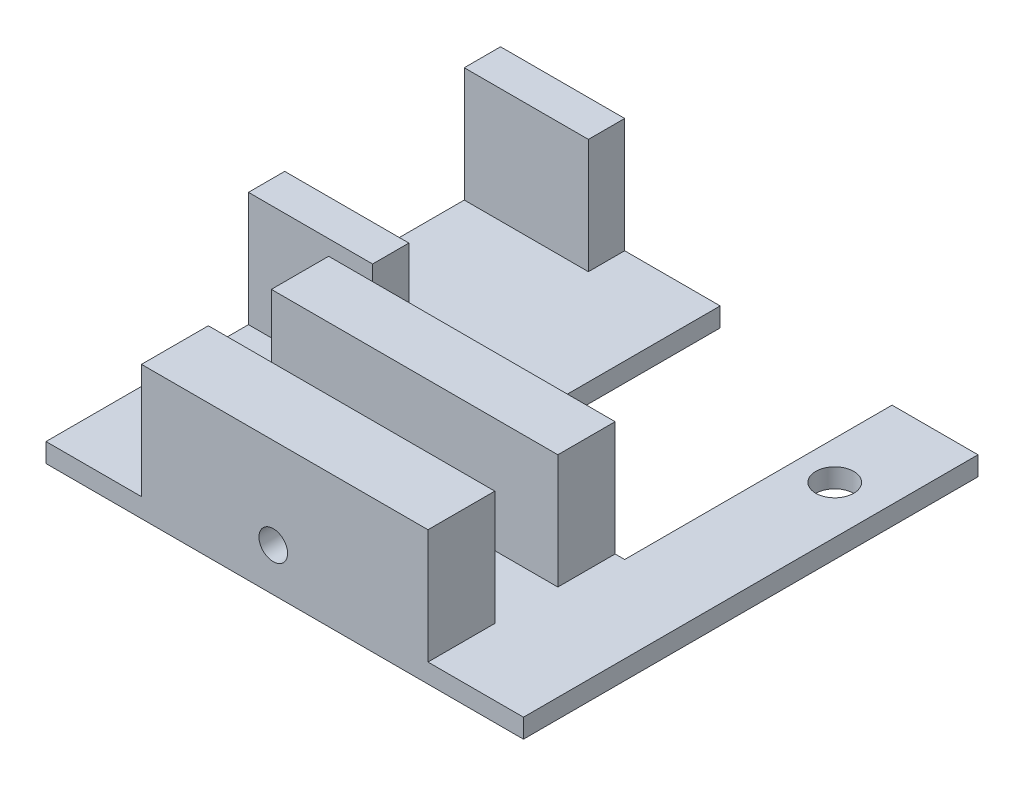
ISO-10303-21;
HEADER;
FILE_DESCRIPTION(('STEP AP214'),'2;1');
FILE_NAME('part.step','',(''),(''),'','','');
FILE_SCHEMA(('AUTOMOTIVE_DESIGN { 1 0 10303 214 1 1 1 1 }'));
ENDSEC;
DATA;
#1=APPLICATION_CONTEXT('core data for automotive mechanical design processes');
#2=APPLICATION_PROTOCOL_DEFINITION('international standard','automotive_design',2000,#1);
#3=PRODUCT_CONTEXT('',#1,'mechanical');
#4=PRODUCT('Part','Part','',(#3));
#5=PRODUCT_RELATED_PRODUCT_CATEGORY('part','',(#4));
#6=PRODUCT_DEFINITION_FORMATION('','',#4);
#7=PRODUCT_DEFINITION_CONTEXT('part definition',#1,'design');
#8=PRODUCT_DEFINITION('design','',#6,#7);
#9=PRODUCT_DEFINITION_SHAPE('','',#8);
#10=(LENGTH_UNIT() NAMED_UNIT(*) SI_UNIT(.MILLI.,.METRE.));
#11=(NAMED_UNIT(*) PLANE_ANGLE_UNIT() SI_UNIT($,.RADIAN.));
#12=(NAMED_UNIT(*) SI_UNIT($,.STERADIAN.) SOLID_ANGLE_UNIT());
#13=UNCERTAINTY_MEASURE_WITH_UNIT(LENGTH_MEASURE(1.E-05),#10,'distance_accuracy_value','');
#14=(GEOMETRIC_REPRESENTATION_CONTEXT(3) GLOBAL_UNCERTAINTY_ASSIGNED_CONTEXT((#13)) GLOBAL_UNIT_ASSIGNED_CONTEXT((#10,
#11,#12)) REPRESENTATION_CONTEXT('',''));
#15=CARTESIAN_POINT('',(0.,0.,0.));
#16=DIRECTION('',(0.,0.,1.));
#17=DIRECTION('',(1.,0.,0.));
#18=AXIS2_PLACEMENT_3D('',#15,#16,#17);
#19=CARTESIAN_POINT('',(0.,1.27,0.));
#20=DIRECTION('',(0.,-1.,0.));
#21=DIRECTION('',(0.,0.,-1.));
#22=AXIS2_PLACEMENT_3D('',#19,#20,#21);
#23=PLANE('',#22);
#24=CARTESIAN_POINT('',(-6.34999999999987,1.27,1.524));
#25=DIRECTION('',(0.,1.,0.));
#26=DIRECTION('',(0.,0.,1.));
#27=AXIS2_PLACEMENT_3D('',#24,#25,#26);
#28=CIRCLE('',#27,2.52729999999999);
#29=CARTESIAN_POINT('',(-6.34999999999987,1.27,4.0513));
#30=VERTEX_POINT('',#29);
#31=EDGE_CURVE('E913',#30,#30,#28,.T.);
#32=ORIENTED_EDGE('',*,*,#31,.F.);
#33=EDGE_LOOP('',(#32));
#34=FACE_BOUND('',#33,.T.);
#35=CARTESIAN_POINT('',(-19.05,1.27,17.399));
#36=DIRECTION('',(0.,1.,0.));
#37=DIRECTION('',(0.,0.,1.));
#38=AXIS2_PLACEMENT_3D('',#35,#36,#37);
#39=CIRCLE('',#38,2.5273);
#40=CARTESIAN_POINT('',(-19.05,1.27,19.9263));
#41=VERTEX_POINT('',#40);
#42=EDGE_CURVE('E905',#41,#41,#39,.T.);
#43=ORIENTED_EDGE('',*,*,#42,.F.);
#44=EDGE_LOOP('',(#43));
#45=FACE_BOUND('',#44,.T.);
#46=CARTESIAN_POINT('',(25.4,1.27,-17.526));
#47=DIRECTION('',(0.,1.,0.));
#48=DIRECTION('',(0.,0.,1.));
#49=AXIS2_PLACEMENT_3D('',#46,#47,#48);
#50=CIRCLE('',#49,2.5273);
#51=CARTESIAN_POINT('',(25.4,1.27,-14.9987));
#52=VERTEX_POINT('',#51);
#53=EDGE_CURVE('E897',#52,#52,#50,.T.);
#54=ORIENTED_EDGE('',*,*,#53,.F.);
#55=EDGE_LOOP('',(#54));
#56=FACE_BOUND('',#55,.T.);
#57=DIRECTION('',(0.,0.,1.));
#58=VECTOR('',#57,1.);
#59=CARTESIAN_POINT('',(-2.53999999999988,1.27,0.));
#60=LINE('',#59,#58);
#61=CARTESIAN_POINT('',(-2.53999999999988,1.27,-30.226));
#62=VERTEX_POINT('',#61);
#63=CARTESIAN_POINT('',(-2.53999999999988,1.27,5.334));
#64=VERTEX_POINT('',#63);
#65=EDGE_CURVE('E338',#62,#64,#60,.T.);
#66=ORIENTED_EDGE('',*,*,#65,.F.);
#67=DIRECTION('',(-1.,0.,0.));
#68=VECTOR('',#67,1.);
#69=CARTESIAN_POINT('',(-31.75,1.27,-30.226));
#70=LINE('',#69,#68);
#71=CARTESIAN_POINT('',(-15.24,1.27,-30.226));
#72=VERTEX_POINT('',#71);
#73=EDGE_CURVE('E224',#62,#72,#70,.T.);
#74=ORIENTED_EDGE('',*,*,#73,.T.);
#75=DIRECTION('',(0.,0.,-1.));
#76=VECTOR('',#75,1.);
#77=CARTESIAN_POINT('',(-15.24,1.27,-30.226));
#78=LINE('',#77,#76);
#79=CARTESIAN_POINT('',(-15.24,1.27,-25.4));
#80=VERTEX_POINT('',#79);
#81=EDGE_CURVE('E289',#80,#72,#78,.T.);
#82=ORIENTED_EDGE('',*,*,#81,.F.);
#83=DIRECTION('',(1.,0.,0.));
#84=VECTOR('',#83,1.);
#85=CARTESIAN_POINT('',(-31.75,1.27,-25.4));
#86=LINE('',#85,#84);
#87=CARTESIAN_POINT('',(-31.75,1.27,-25.4));
#88=VERTEX_POINT('',#87);
#89=EDGE_CURVE('E285',#88,#80,#86,.T.);
#90=ORIENTED_EDGE('',*,*,#89,.F.);
#91=DIRECTION('',(0.,0.,1.));
#92=VECTOR('',#91,1.);
#93=CARTESIAN_POINT('',(-31.75,1.27,30.226));
#94=LINE('',#93,#92);
#95=CARTESIAN_POINT('',(-31.75,1.27,-1.524));
#96=VERTEX_POINT('',#95);
#97=EDGE_CURVE('E308',#88,#96,#94,.T.);
#98=ORIENTED_EDGE('',*,*,#97,.T.);
#99=DIRECTION('',(-1.,0.,0.));
#100=VECTOR('',#99,1.);
#101=CARTESIAN_POINT('',(-31.75,1.27,-1.524));
#102=LINE('',#101,#100);
#103=CARTESIAN_POINT('',(-15.24,1.27,-1.524));
#104=VERTEX_POINT('',#103);
#105=EDGE_CURVE('E455',#104,#96,#102,.T.);
#106=ORIENTED_EDGE('',*,*,#105,.F.);
#107=DIRECTION('',(0.,0.,-1.));
#108=VECTOR('',#107,1.);
#109=CARTESIAN_POINT('',(-15.24,1.27,-1.524));
#110=LINE('',#109,#108);
#111=CARTESIAN_POINT('',(-15.24,1.27,3.302));
#112=VERTEX_POINT('',#111);
#113=EDGE_CURVE('E459',#112,#104,#110,.T.);
#114=ORIENTED_EDGE('',*,*,#113,.F.);
#115=DIRECTION('',(1.,0.,0.));
#116=VECTOR('',#115,1.);
#117=CARTESIAN_POINT('',(-31.75,1.27,3.302));
#118=LINE('',#117,#116);
#119=CARTESIAN_POINT('',(-31.75,1.27,3.302));
#120=VERTEX_POINT('',#119);
#121=EDGE_CURVE('E290',#120,#112,#118,.T.);
#122=ORIENTED_EDGE('',*,*,#121,.F.);
#123=CARTESIAN_POINT('',(-31.75,1.27,30.226));
#124=VERTEX_POINT('',#123);
#125=EDGE_CURVE('E307',#120,#124,#94,.T.);
#126=ORIENTED_EDGE('',*,*,#125,.T.);
#127=DIRECTION('',(1.,0.,0.));
#128=VECTOR('',#127,1.);
#129=CARTESIAN_POINT('',(-31.75,1.27,30.226));
#130=LINE('',#129,#128);
#131=CARTESIAN_POINT('',(-19.05,1.27,30.226));
#132=VERTEX_POINT('',#131);
#133=EDGE_CURVE('E255',#124,#132,#130,.T.);
#134=ORIENTED_EDGE('',*,*,#133,.T.);
#135=DIRECTION('',(0.,0.,1.));
#136=VECTOR('',#135,1.);
#137=CARTESIAN_POINT('',(-19.05,1.27,30.226));
#138=LINE('',#137,#136);
#139=CARTESIAN_POINT('',(-19.05,1.27,21.336));
#140=VERTEX_POINT('',#139);
#141=EDGE_CURVE('E423',#140,#132,#138,.T.);
#142=ORIENTED_EDGE('',*,*,#141,.F.);
#143=DIRECTION('',(-1.,0.,0.));
#144=VECTOR('',#143,1.);
#145=CARTESIAN_POINT('',(-19.05,1.27,21.336));
#146=LINE('',#145,#144);
#147=CARTESIAN_POINT('',(19.05,1.27,21.336));
#148=VERTEX_POINT('',#147);
#149=EDGE_CURVE('E416',#148,#140,#146,.T.);
#150=ORIENTED_EDGE('',*,*,#149,.F.);
#151=DIRECTION('',(0.,0.,-1.));
#152=VECTOR('',#151,1.);
#153=CARTESIAN_POINT('',(19.05,1.27,30.226));
#154=LINE('',#153,#152);
#155=CARTESIAN_POINT('',(19.05,1.27,30.226));
#156=VERTEX_POINT('',#155);
#157=EDGE_CURVE('E321',#156,#148,#154,.T.);
#158=ORIENTED_EDGE('',*,*,#157,.F.);
#159=CARTESIAN_POINT('',(31.75,1.27,30.226));
#160=VERTEX_POINT('',#159);
#161=EDGE_CURVE('E310',#156,#160,#130,.T.);
#162=ORIENTED_EDGE('',*,*,#161,.T.);
#163=DIRECTION('',(0.,0.,-1.));
#164=VECTOR('',#163,1.);
#165=CARTESIAN_POINT('',(31.75,1.27,30.226));
#166=LINE('',#165,#164);
#167=CARTESIAN_POINT('',(31.75,1.27,-30.226));
#168=VERTEX_POINT('',#167);
#169=EDGE_CURVE('E249',#160,#168,#166,.T.);
#170=ORIENTED_EDGE('',*,*,#169,.T.);
#171=CARTESIAN_POINT('',(20.32,1.27,-30.226));
#172=VERTEX_POINT('',#171);
#173=EDGE_CURVE('E303',#168,#172,#70,.T.);
#174=ORIENTED_EDGE('',*,*,#173,.T.);
#175=DIRECTION('',(0.,0.,1.));
#176=VECTOR('',#175,1.);
#177=CARTESIAN_POINT('',(20.3200000000001,1.27,0.));
#178=LINE('',#177,#176);
#179=CARTESIAN_POINT('',(20.32,1.27,5.334));
#180=VERTEX_POINT('',#179);
#181=EDGE_CURVE('E331',#172,#180,#178,.T.);
#182=ORIENTED_EDGE('',*,*,#181,.T.);
#183=DIRECTION('',(-1.,0.,0.));
#184=VECTOR('',#183,1.);
#185=CARTESIAN_POINT('',(0.,1.27,5.334));
#186=LINE('',#185,#184);
#187=CARTESIAN_POINT('',(19.05,1.27,5.334));
#188=VERTEX_POINT('',#187);
#189=EDGE_CURVE('E333',#180,#188,#186,.T.);
#190=ORIENTED_EDGE('',*,*,#189,.T.);
#191=DIRECTION('',(0.,0.,-1.));
#192=VECTOR('',#191,1.);
#193=CARTESIAN_POINT('',(19.05,1.27,12.954));
#194=LINE('',#193,#192);
#195=CARTESIAN_POINT('',(19.05,1.27,12.954));
#196=VERTEX_POINT('',#195);
#197=EDGE_CURVE('E377',#196,#188,#194,.T.);
#198=ORIENTED_EDGE('',*,*,#197,.F.);
#199=DIRECTION('',(1.,0.,0.));
#200=VECTOR('',#199,1.);
#201=CARTESIAN_POINT('',(-19.05,1.27,12.954));
#202=LINE('',#201,#200);
#203=CARTESIAN_POINT('',(-1.52400000000001,1.27,12.954));
#204=VERTEX_POINT('',#203);
#205=EDGE_CURVE('E381',#204,#196,#202,.T.);
#206=ORIENTED_EDGE('',*,*,#205,.F.);
#207=CARTESIAN_POINT('',(-19.05,1.27,12.954));
#208=VERTEX_POINT('',#207);
#209=EDGE_CURVE('E382',#208,#204,#202,.T.);
#210=ORIENTED_EDGE('',*,*,#209,.F.);
#211=DIRECTION('',(0.,0.,1.));
#212=VECTOR('',#211,1.);
#213=CARTESIAN_POINT('',(-19.05,1.27,12.954));
#214=LINE('',#213,#212);
#215=CARTESIAN_POINT('',(-19.05,1.27,5.334));
#216=VERTEX_POINT('',#215);
#217=EDGE_CURVE('E386',#216,#208,#214,.T.);
#218=ORIENTED_EDGE('',*,*,#217,.F.);
#219=DIRECTION('',(-1.,0.,0.));
#220=VECTOR('',#219,1.);
#221=CARTESIAN_POINT('',(-19.05,1.27,5.334));
#222=LINE('',#221,#220);
#223=EDGE_CURVE('E374',#64,#216,#222,.T.);
#224=ORIENTED_EDGE('',*,*,#223,.F.);
#225=EDGE_LOOP('',(#66,#74,#82,#90,#98,#106,#114,#122,#126,#134,#142,#150,#158,#162,#170,#174,
#182,#190,#198,#206,#210,#218,#224));
#226=FACE_BOUND('',#225,.T.);
#227=ADVANCED_FACE('F45',(#34,#45,#56,#226),#23,.F.);
#228=CARTESIAN_POINT('',(-31.75,1.27,-30.226));
#229=DIRECTION('',(0.,0.,1.));
#230=DIRECTION('',(1.,0.,0.));
#231=AXIS2_PLACEMENT_3D('',#228,#229,#230);
#232=PLANE('',#231);
#233=DIRECTION('',(0.,-1.,0.));
#234=VECTOR('',#233,1.);
#235=CARTESIAN_POINT('',(-2.53999999999988,16.51,-30.226));
#236=LINE('',#235,#234);
#237=CARTESIAN_POINT('',(-2.53999999999988,-1.27,-30.226));
#238=VERTEX_POINT('',#237);
#239=EDGE_CURVE('E206',#62,#238,#236,.T.);
#240=ORIENTED_EDGE('',*,*,#239,.T.);
#241=DIRECTION('',(-1.,0.,0.));
#242=VECTOR('',#241,1.);
#243=CARTESIAN_POINT('',(-31.75,-1.27,-30.226));
#244=LINE('',#243,#242);
#245=CARTESIAN_POINT('',(-31.75,-1.27,-30.226));
#246=VERTEX_POINT('',#245);
#247=EDGE_CURVE('E221',#238,#246,#244,.T.);
#248=ORIENTED_EDGE('',*,*,#247,.T.);
#249=DIRECTION('',(0.,-1.,0.));
#250=VECTOR('',#249,1.);
#251=CARTESIAN_POINT('',(-31.75,1.27,-30.226));
#252=LINE('',#251,#250);
#253=CARTESIAN_POINT('',(-31.75,16.51,-30.226));
#254=VERTEX_POINT('',#253);
#255=EDGE_CURVE('E54',#254,#246,#252,.T.);
#256=ORIENTED_EDGE('',*,*,#255,.F.);
#257=DIRECTION('',(-1.,0.,0.));
#258=VECTOR('',#257,1.);
#259=CARTESIAN_POINT('',(-31.75,16.51,-30.226));
#260=LINE('',#259,#258);
#261=CARTESIAN_POINT('',(-15.24,16.51,-30.226));
#262=VERTEX_POINT('',#261);
#263=EDGE_CURVE('E268',#262,#254,#260,.T.);
#264=ORIENTED_EDGE('',*,*,#263,.F.);
#265=DIRECTION('',(0.,-1.,0.));
#266=VECTOR('',#265,1.);
#267=CARTESIAN_POINT('',(-15.24,16.51,-30.226));
#268=LINE('',#267,#266);
#269=EDGE_CURVE('E275',#262,#72,#268,.T.);
#270=ORIENTED_EDGE('',*,*,#269,.T.);
#271=ORIENTED_EDGE('',*,*,#73,.F.);
#272=EDGE_LOOP('',(#240,#248,#256,#264,#270,#271));
#273=FACE_BOUND('',#272,.T.);
#274=ADVANCED_FACE('F220',(#273),#232,.F.);
#275=CARTESIAN_POINT('',(0.,-1.27,0.));
#276=DIRECTION('',(0.,-1.,0.));
#277=DIRECTION('',(0.,0.,-1.));
#278=AXIS2_PLACEMENT_3D('',#275,#276,#277);
#279=PLANE('',#278);
#280=CARTESIAN_POINT('',(-6.34999999999987,-1.27,1.524));
#281=DIRECTION('',(0.,1.,0.));
#282=DIRECTION('',(0.,0.,1.));
#283=AXIS2_PLACEMENT_3D('',#280,#281,#282);
#284=CIRCLE('',#283,2.5273);
#285=CARTESIAN_POINT('',(-6.34999999999987,-1.27,4.0513));
#286=VERTEX_POINT('',#285);
#287=EDGE_CURVE('E909',#286,#286,#284,.T.);
#288=ORIENTED_EDGE('',*,*,#287,.T.);
#289=EDGE_LOOP('',(#288));
#290=FACE_BOUND('',#289,.T.);
#291=CARTESIAN_POINT('',(-19.05,-1.27,17.399));
#292=DIRECTION('',(0.,1.,0.));
#293=DIRECTION('',(0.,0.,1.));
#294=AXIS2_PLACEMENT_3D('',#291,#292,#293);
#295=CIRCLE('',#294,2.5273);
#296=CARTESIAN_POINT('',(-19.05,-1.27,19.9263));
#297=VERTEX_POINT('',#296);
#298=EDGE_CURVE('E901',#297,#297,#295,.T.);
#299=ORIENTED_EDGE('',*,*,#298,.T.);
#300=EDGE_LOOP('',(#299));
#301=FACE_BOUND('',#300,.T.);
#302=CARTESIAN_POINT('',(25.4,-1.27,-17.526));
#303=DIRECTION('',(0.,1.,0.));
#304=DIRECTION('',(0.,0.,1.));
#305=AXIS2_PLACEMENT_3D('',#302,#303,#304);
#306=CIRCLE('',#305,2.5273);
#307=CARTESIAN_POINT('',(25.4,-1.27,-14.9987));
#308=VERTEX_POINT('',#307);
#309=EDGE_CURVE('E216',#308,#308,#306,.T.);
#310=ORIENTED_EDGE('',*,*,#309,.T.);
#311=EDGE_LOOP('',(#310));
#312=FACE_BOUND('',#311,.T.);
#313=ORIENTED_EDGE('',*,*,#247,.F.);
#314=DIRECTION('',(0.,0.,1.));
#315=VECTOR('',#314,1.);
#316=CARTESIAN_POINT('',(-2.53999999999988,-1.27,0.));
#317=LINE('',#316,#315);
#318=CARTESIAN_POINT('',(-2.53999999999988,-1.27,5.334));
#319=VERTEX_POINT('',#318);
#320=EDGE_CURVE('E203',#238,#319,#317,.T.);
#321=ORIENTED_EDGE('',*,*,#320,.T.);
#322=DIRECTION('',(-1.,0.,0.));
#323=VECTOR('',#322,1.);
#324=CARTESIAN_POINT('',(0.,-1.27,5.334));
#325=LINE('',#324,#323);
#326=CARTESIAN_POINT('',(20.32,-1.27,5.334));
#327=VERTEX_POINT('',#326);
#328=EDGE_CURVE('E226',#327,#319,#325,.T.);
#329=ORIENTED_EDGE('',*,*,#328,.F.);
#330=DIRECTION('',(0.,0.,1.));
#331=VECTOR('',#330,1.);
#332=CARTESIAN_POINT('',(20.3200000000001,-1.27,0.));
#333=LINE('',#332,#331);
#334=CARTESIAN_POINT('',(20.32,-1.27,-30.226));
#335=VERTEX_POINT('',#334);
#336=EDGE_CURVE('E215',#335,#327,#333,.T.);
#337=ORIENTED_EDGE('',*,*,#336,.F.);
#338=CARTESIAN_POINT('',(31.75,-1.27,-30.226));
#339=VERTEX_POINT('',#338);
#340=EDGE_CURVE('E233',#339,#335,#244,.T.);
#341=ORIENTED_EDGE('',*,*,#340,.F.);
#342=DIRECTION('',(0.,0.,-1.));
#343=VECTOR('',#342,1.);
#344=CARTESIAN_POINT('',(31.75,-1.27,30.226));
#345=LINE('',#344,#343);
#346=CARTESIAN_POINT('',(31.75,-1.27,30.226));
#347=VERTEX_POINT('',#346);
#348=EDGE_CURVE('E234',#347,#339,#345,.T.);
#349=ORIENTED_EDGE('',*,*,#348,.F.);
#350=DIRECTION('',(1.,0.,0.));
#351=VECTOR('',#350,1.);
#352=CARTESIAN_POINT('',(-31.75,-1.27,30.226));
#353=LINE('',#352,#351);
#354=CARTESIAN_POINT('',(-31.75,-1.27,30.226));
#355=VERTEX_POINT('',#354);
#356=EDGE_CURVE('E246',#355,#347,#353,.T.);
#357=ORIENTED_EDGE('',*,*,#356,.F.);
#358=DIRECTION('',(0.,0.,1.));
#359=VECTOR('',#358,1.);
#360=CARTESIAN_POINT('',(-31.75,-1.27,30.226));
#361=LINE('',#360,#359);
#362=EDGE_CURVE('E231',#246,#355,#361,.T.);
#363=ORIENTED_EDGE('',*,*,#362,.F.);
#364=EDGE_LOOP('',(#313,#321,#329,#337,#341,#349,#357,#363));
#365=FACE_BOUND('',#364,.T.);
#366=ADVANCED_FACE('F229',(#290,#301,#312,#365),#279,.T.);
#367=CARTESIAN_POINT('',(31.75,1.27,30.226));
#368=DIRECTION('',(-1.,0.,0.));
#369=DIRECTION('',(0.,0.,1.));
#370=AXIS2_PLACEMENT_3D('',#367,#368,#369);
#371=PLANE('',#370);
#372=ORIENTED_EDGE('',*,*,#348,.T.);
#373=DIRECTION('',(0.,-1.,0.));
#374=VECTOR('',#373,1.);
#375=CARTESIAN_POINT('',(31.75,1.27,-30.226));
#376=LINE('',#375,#374);
#377=EDGE_CURVE('E12',#168,#339,#376,.T.);
#378=ORIENTED_EDGE('',*,*,#377,.F.);
#379=ORIENTED_EDGE('',*,*,#169,.F.);
#380=DIRECTION('',(0.,-1.,0.));
#381=VECTOR('',#380,1.);
#382=CARTESIAN_POINT('',(31.75,1.27,30.226));
#383=LINE('',#382,#381);
#384=EDGE_CURVE('E250',#160,#347,#383,.T.);
#385=ORIENTED_EDGE('',*,*,#384,.T.);
#386=EDGE_LOOP('',(#372,#378,#379,#385));
#387=FACE_BOUND('',#386,.T.);
#388=ADVANCED_FACE('F47',(#387),#371,.F.);
#389=ORIENTED_EDGE('',*,*,#340,.T.);
#390=DIRECTION('',(0.,-1.,0.));
#391=VECTOR('',#390,1.);
#392=CARTESIAN_POINT('',(20.32,16.51,-30.226));
#393=LINE('',#392,#391);
#394=EDGE_CURVE('E61',#172,#335,#393,.T.);
#395=ORIENTED_EDGE('',*,*,#394,.F.);
#396=ORIENTED_EDGE('',*,*,#173,.F.);
#397=ORIENTED_EDGE('',*,*,#377,.T.);
#398=EDGE_LOOP('',(#389,#395,#396,#397));
#399=FACE_BOUND('',#398,.T.);
#400=ADVANCED_FACE('F329',(#399),#232,.F.);
#401=CARTESIAN_POINT('',(-31.75,1.27,30.226));
#402=DIRECTION('',(1.,0.,0.));
#403=DIRECTION('',(0.,0.,-1.));
#404=AXIS2_PLACEMENT_3D('',#401,#402,#403);
#405=PLANE('',#404);
#406=ORIENTED_EDGE('',*,*,#362,.T.);
#407=DIRECTION('',(0.,-1.,0.));
#408=VECTOR('',#407,1.);
#409=CARTESIAN_POINT('',(-31.75,1.27,30.226));
#410=LINE('',#409,#408);
#411=EDGE_CURVE('E254',#124,#355,#410,.T.);
#412=ORIENTED_EDGE('',*,*,#411,.F.);
#413=ORIENTED_EDGE('',*,*,#125,.F.);
#414=DIRECTION('',(0.,-1.,0.));
#415=VECTOR('',#414,1.);
#416=CARTESIAN_POINT('',(-31.75,16.51,3.302));
#417=LINE('',#416,#415);
#418=CARTESIAN_POINT('',(-31.75,16.51,3.302));
#419=VERTEX_POINT('',#418);
#420=EDGE_CURVE('E427',#419,#120,#417,.T.);
#421=ORIENTED_EDGE('',*,*,#420,.F.);
#422=DIRECTION('',(0.,0.,1.));
#423=VECTOR('',#422,1.);
#424=CARTESIAN_POINT('',(-31.75,16.51,-1.524));
#425=LINE('',#424,#423);
#426=CARTESIAN_POINT('',(-31.75,16.51,-1.524));
#427=VERTEX_POINT('',#426);
#428=EDGE_CURVE('E460',#427,#419,#425,.T.);
#429=ORIENTED_EDGE('',*,*,#428,.F.);
#430=DIRECTION('',(0.,-1.,0.));
#431=VECTOR('',#430,1.);
#432=CARTESIAN_POINT('',(-31.75,16.51,-1.524));
#433=LINE('',#432,#431);
#434=EDGE_CURVE('E450',#427,#96,#433,.T.);
#435=ORIENTED_EDGE('',*,*,#434,.T.);
#436=ORIENTED_EDGE('',*,*,#97,.F.);
#437=DIRECTION('',(0.,-1.,0.));
#438=VECTOR('',#437,1.);
#439=CARTESIAN_POINT('',(-31.75,16.51,-25.4));
#440=LINE('',#439,#438);
#441=CARTESIAN_POINT('',(-31.75,16.51,-25.4));
#442=VERTEX_POINT('',#441);
#443=EDGE_CURVE('E240',#442,#88,#440,.T.);
#444=ORIENTED_EDGE('',*,*,#443,.F.);
#445=DIRECTION('',(0.,0.,1.));
#446=VECTOR('',#445,1.);
#447=CARTESIAN_POINT('',(-31.75,16.51,-30.226));
#448=LINE('',#447,#446);
#449=EDGE_CURVE('E265',#254,#442,#448,.T.);
#450=ORIENTED_EDGE('',*,*,#449,.F.);
#451=ORIENTED_EDGE('',*,*,#255,.T.);
#452=EDGE_LOOP('',(#406,#412,#413,#421,#429,#435,#436,#444,#450,#451));
#453=FACE_BOUND('',#452,.T.);
#454=ADVANCED_FACE('F261',(#453),#405,.F.);
#455=CARTESIAN_POINT('',(-31.75,1.27,30.226));
#456=DIRECTION('',(0.,0.,-1.));
#457=DIRECTION('',(-1.,0.,0.));
#458=AXIS2_PLACEMENT_3D('',#455,#456,#457);
#459=PLANE('',#458);
#460=CARTESIAN_POINT('',(-1.52400000000001,4.445,30.226));
#461=DIRECTION('',(0.,0.,-1.));
#462=DIRECTION('',(-1.,0.,0.));
#463=AXIS2_PLACEMENT_3D('',#460,#461,#462);
#464=CIRCLE('',#463,1.905);
#465=CARTESIAN_POINT('',(-3.42900000000001,4.445,30.226));
#466=VERTEX_POINT('',#465);
#467=EDGE_CURVE('E349',#466,#466,#464,.T.);
#468=ORIENTED_EDGE('',*,*,#467,.T.);
#469=EDGE_LOOP('',(#468));
#470=FACE_BOUND('',#469,.T.);
#471=ORIENTED_EDGE('',*,*,#356,.T.);
#472=ORIENTED_EDGE('',*,*,#384,.F.);
#473=ORIENTED_EDGE('',*,*,#161,.F.);
#474=DIRECTION('',(0.,-1.,0.));
#475=VECTOR('',#474,1.);
#476=CARTESIAN_POINT('',(19.05,16.51,30.226));
#477=LINE('',#476,#475);
#478=CARTESIAN_POINT('',(19.05,16.51,30.226));
#479=VERTEX_POINT('',#478);
#480=EDGE_CURVE('E404',#479,#156,#477,.T.);
#481=ORIENTED_EDGE('',*,*,#480,.F.);
#482=DIRECTION('',(1.,0.,0.));
#483=VECTOR('',#482,1.);
#484=CARTESIAN_POINT('',(-19.05,16.51,30.226));
#485=LINE('',#484,#483);
#486=CARTESIAN_POINT('',(-19.05,16.51,30.226));
#487=VERTEX_POINT('',#486);
#488=EDGE_CURVE('E433',#487,#479,#485,.T.);
#489=ORIENTED_EDGE('',*,*,#488,.F.);
#490=DIRECTION('',(0.,-1.,0.));
#491=VECTOR('',#490,1.);
#492=CARTESIAN_POINT('',(-19.05,16.51,30.226));
#493=LINE('',#492,#491);
#494=EDGE_CURVE('E390',#487,#132,#493,.T.);
#495=ORIENTED_EDGE('',*,*,#494,.T.);
#496=ORIENTED_EDGE('',*,*,#133,.F.);
#497=ORIENTED_EDGE('',*,*,#411,.T.);
#498=EDGE_LOOP('',(#471,#472,#473,#481,#489,#495,#496,#497));
#499=FACE_BOUND('',#498,.T.);
#500=ADVANCED_FACE('F325',(#470,#499),#459,.F.);
#501=CARTESIAN_POINT('',(-31.75,16.51,-25.4));
#502=DIRECTION('',(0.,0.,-1.));
#503=DIRECTION('',(-1.,0.,0.));
#504=AXIS2_PLACEMENT_3D('',#501,#502,#503);
#505=PLANE('',#504);
#506=ORIENTED_EDGE('',*,*,#89,.T.);
#507=DIRECTION('',(0.,-1.,0.));
#508=VECTOR('',#507,1.);
#509=CARTESIAN_POINT('',(-15.24,16.51,-25.4));
#510=LINE('',#509,#508);
#511=CARTESIAN_POINT('',(-15.24,16.51,-25.4));
#512=VERTEX_POINT('',#511);
#513=EDGE_CURVE('E279',#512,#80,#510,.T.);
#514=ORIENTED_EDGE('',*,*,#513,.F.);
#515=DIRECTION('',(1.,0.,0.));
#516=VECTOR('',#515,1.);
#517=CARTESIAN_POINT('',(-31.75,16.51,-25.4));
#518=LINE('',#517,#516);
#519=EDGE_CURVE('E281',#442,#512,#518,.T.);
#520=ORIENTED_EDGE('',*,*,#519,.F.);
#521=ORIENTED_EDGE('',*,*,#443,.T.);
#522=EDGE_LOOP('',(#506,#514,#520,#521));
#523=FACE_BOUND('',#522,.T.);
#524=ADVANCED_FACE('F482',(#523),#505,.F.);
#525=CARTESIAN_POINT('',(-15.24,16.51,-30.226));
#526=DIRECTION('',(-1.,0.,0.));
#527=DIRECTION('',(0.,0.,1.));
#528=AXIS2_PLACEMENT_3D('',#525,#526,#527);
#529=PLANE('',#528);
#530=ORIENTED_EDGE('',*,*,#81,.T.);
#531=ORIENTED_EDGE('',*,*,#269,.F.);
#532=DIRECTION('',(0.,0.,-1.));
#533=VECTOR('',#532,1.);
#534=CARTESIAN_POINT('',(-15.24,16.51,-30.226));
#535=LINE('',#534,#533);
#536=EDGE_CURVE('E272',#512,#262,#535,.T.);
#537=ORIENTED_EDGE('',*,*,#536,.F.);
#538=ORIENTED_EDGE('',*,*,#513,.T.);
#539=EDGE_LOOP('',(#530,#531,#537,#538));
#540=FACE_BOUND('',#539,.T.);
#541=ADVANCED_FACE('F484',(#540),#529,.F.);
#542=CARTESIAN_POINT('',(0.,16.51,0.));
#543=DIRECTION('',(0.,1.,0.));
#544=DIRECTION('',(0.,0.,1.));
#545=AXIS2_PLACEMENT_3D('',#542,#543,#544);
#546=PLANE('',#545);
#547=ORIENTED_EDGE('',*,*,#449,.T.);
#548=ORIENTED_EDGE('',*,*,#519,.T.);
#549=ORIENTED_EDGE('',*,*,#536,.T.);
#550=ORIENTED_EDGE('',*,*,#263,.T.);
#551=EDGE_LOOP('',(#547,#548,#549,#550));
#552=FACE_BOUND('',#551,.T.);
#553=ADVANCED_FACE('F270',(#552),#546,.T.);
#554=CARTESIAN_POINT('',(-31.75,16.51,3.302));
#555=DIRECTION('',(0.,0.,-1.));
#556=DIRECTION('',(-1.,0.,0.));
#557=AXIS2_PLACEMENT_3D('',#554,#555,#556);
#558=PLANE('',#557);
#559=ORIENTED_EDGE('',*,*,#121,.T.);
#560=DIRECTION('',(0.,-1.,0.));
#561=VECTOR('',#560,1.);
#562=CARTESIAN_POINT('',(-15.24,16.51,3.302));
#563=LINE('',#562,#561);
#564=CARTESIAN_POINT('',(-15.24,16.51,3.302));
#565=VERTEX_POINT('',#564);
#566=EDGE_CURVE('E442',#565,#112,#563,.T.);
#567=ORIENTED_EDGE('',*,*,#566,.F.);
#568=DIRECTION('',(1.,0.,0.));
#569=VECTOR('',#568,1.);
#570=CARTESIAN_POINT('',(-31.75,16.51,3.302));
#571=LINE('',#570,#569);
#572=EDGE_CURVE('E472',#419,#565,#571,.T.);
#573=ORIENTED_EDGE('',*,*,#572,.F.);
#574=ORIENTED_EDGE('',*,*,#420,.T.);
#575=EDGE_LOOP('',(#559,#567,#573,#574));
#576=FACE_BOUND('',#575,.T.);
#577=ADVANCED_FACE('F784',(#576),#558,.F.);
#578=CARTESIAN_POINT('',(-15.24,16.51,-1.524));
#579=DIRECTION('',(-1.,0.,0.));
#580=DIRECTION('',(0.,0.,1.));
#581=AXIS2_PLACEMENT_3D('',#578,#579,#580);
#582=PLANE('',#581);
#583=ORIENTED_EDGE('',*,*,#113,.T.);
#584=DIRECTION('',(0.,-1.,0.));
#585=VECTOR('',#584,1.);
#586=CARTESIAN_POINT('',(-15.24,16.51,-1.524));
#587=LINE('',#586,#585);
#588=CARTESIAN_POINT('',(-15.24,16.51,-1.524));
#589=VERTEX_POINT('',#588);
#590=EDGE_CURVE('E446',#589,#104,#587,.T.);
#591=ORIENTED_EDGE('',*,*,#590,.F.);
#592=DIRECTION('',(0.,0.,-1.));
#593=VECTOR('',#592,1.);
#594=CARTESIAN_POINT('',(-15.24,16.51,-1.524));
#595=LINE('',#594,#593);
#596=EDGE_CURVE('E469',#565,#589,#595,.T.);
#597=ORIENTED_EDGE('',*,*,#596,.F.);
#598=ORIENTED_EDGE('',*,*,#566,.T.);
#599=EDGE_LOOP('',(#583,#591,#597,#598));
#600=FACE_BOUND('',#599,.T.);
#601=ADVANCED_FACE('F774',(#600),#582,.F.);
#602=CARTESIAN_POINT('',(-31.75,16.51,-1.524));
#603=DIRECTION('',(0.,0.,1.));
#604=DIRECTION('',(1.,0.,0.));
#605=AXIS2_PLACEMENT_3D('',#602,#603,#604);
#606=PLANE('',#605);
#607=ORIENTED_EDGE('',*,*,#105,.T.);
#608=ORIENTED_EDGE('',*,*,#434,.F.);
#609=DIRECTION('',(-1.,0.,0.));
#610=VECTOR('',#609,1.);
#611=CARTESIAN_POINT('',(-31.75,16.51,-1.524));
#612=LINE('',#611,#610);
#613=EDGE_CURVE('E454',#589,#427,#612,.T.);
#614=ORIENTED_EDGE('',*,*,#613,.F.);
#615=ORIENTED_EDGE('',*,*,#590,.T.);
#616=EDGE_LOOP('',(#607,#608,#614,#615));
#617=FACE_BOUND('',#616,.T.);
#618=ADVANCED_FACE('F764',(#617),#606,.F.);
#619=CARTESIAN_POINT('',(0.,16.51,0.));
#620=DIRECTION('',(0.,1.,0.));
#621=DIRECTION('',(0.,0.,1.));
#622=AXIS2_PLACEMENT_3D('',#619,#620,#621);
#623=PLANE('',#622);
#624=ORIENTED_EDGE('',*,*,#428,.T.);
#625=ORIENTED_EDGE('',*,*,#572,.T.);
#626=ORIENTED_EDGE('',*,*,#596,.T.);
#627=ORIENTED_EDGE('',*,*,#613,.T.);
#628=EDGE_LOOP('',(#624,#625,#626,#627));
#629=FACE_BOUND('',#628,.T.);
#630=ADVANCED_FACE('F698',(#629),#623,.T.);
#631=CARTESIAN_POINT('',(-19.05,16.51,30.226));
#632=DIRECTION('',(1.,0.,0.));
#633=DIRECTION('',(0.,0.,-1.));
#634=AXIS2_PLACEMENT_3D('',#631,#632,#633);
#635=PLANE('',#634);
#636=ORIENTED_EDGE('',*,*,#141,.T.);
#637=ORIENTED_EDGE('',*,*,#494,.F.);
#638=DIRECTION('',(0.,0.,1.));
#639=VECTOR('',#638,1.);
#640=CARTESIAN_POINT('',(-19.05,16.51,30.226));
#641=LINE('',#640,#639);
#642=CARTESIAN_POINT('',(-19.05,16.51,21.336));
#643=VERTEX_POINT('',#642);
#644=EDGE_CURVE('E420',#643,#487,#641,.T.);
#645=ORIENTED_EDGE('',*,*,#644,.F.);
#646=DIRECTION('',(0.,-1.,0.));
#647=VECTOR('',#646,1.);
#648=CARTESIAN_POINT('',(-19.05,16.51,21.336));
#649=LINE('',#648,#647);
#650=EDGE_CURVE('E411',#643,#140,#649,.T.);
#651=ORIENTED_EDGE('',*,*,#650,.T.);
#652=EDGE_LOOP('',(#636,#637,#645,#651));
#653=FACE_BOUND('',#652,.T.);
#654=ADVANCED_FACE('F494',(#653),#635,.F.);
#655=CARTESIAN_POINT('',(19.05,16.51,30.226));
#656=DIRECTION('',(-1.,0.,0.));
#657=DIRECTION('',(0.,0.,1.));
#658=AXIS2_PLACEMENT_3D('',#655,#656,#657);
#659=PLANE('',#658);
#660=ORIENTED_EDGE('',*,*,#157,.T.);
#661=DIRECTION('',(0.,-1.,0.));
#662=VECTOR('',#661,1.);
#663=CARTESIAN_POINT('',(19.05,16.51,21.336));
#664=LINE('',#663,#662);
#665=CARTESIAN_POINT('',(19.05,16.51,21.336));
#666=VERTEX_POINT('',#665);
#667=EDGE_CURVE('E407',#666,#148,#664,.T.);
#668=ORIENTED_EDGE('',*,*,#667,.F.);
#669=DIRECTION('',(0.,0.,-1.));
#670=VECTOR('',#669,1.);
#671=CARTESIAN_POINT('',(19.05,16.51,30.226));
#672=LINE('',#671,#670);
#673=EDGE_CURVE('E430',#479,#666,#672,.T.);
#674=ORIENTED_EDGE('',*,*,#673,.F.);
#675=ORIENTED_EDGE('',*,*,#480,.T.);
#676=EDGE_LOOP('',(#660,#668,#674,#675));
#677=FACE_BOUND('',#676,.T.);
#678=ADVANCED_FACE('F502',(#677),#659,.F.);
#679=CARTESIAN_POINT('',(-19.05,16.51,21.336));
#680=DIRECTION('',(0.,0.,1.));
#681=DIRECTION('',(1.,0.,0.));
#682=AXIS2_PLACEMENT_3D('',#679,#680,#681);
#683=PLANE('',#682);
#684=CARTESIAN_POINT('',(-1.52400000000001,4.445,21.336));
#685=DIRECTION('',(0.,0.,1.));
#686=DIRECTION('',(1.,0.,0.));
#687=AXIS2_PLACEMENT_3D('',#684,#685,#686);
#688=CIRCLE('',#687,1.905);
#689=CARTESIAN_POINT('',(0.380999999999993,4.445,21.336));
#690=VERTEX_POINT('',#689);
#691=EDGE_CURVE('E353',#690,#690,#688,.T.);
#692=ORIENTED_EDGE('',*,*,#691,.T.);
#693=EDGE_LOOP('',(#692));
#694=FACE_BOUND('',#693,.T.);
#695=ORIENTED_EDGE('',*,*,#149,.T.);
#696=ORIENTED_EDGE('',*,*,#650,.F.);
#697=DIRECTION('',(-1.,0.,0.));
#698=VECTOR('',#697,1.);
#699=CARTESIAN_POINT('',(-19.05,16.51,21.336));
#700=LINE('',#699,#698);
#701=EDGE_CURVE('E415',#666,#643,#700,.T.);
#702=ORIENTED_EDGE('',*,*,#701,.F.);
#703=ORIENTED_EDGE('',*,*,#667,.T.);
#704=EDGE_LOOP('',(#695,#696,#702,#703));
#705=FACE_BOUND('',#704,.T.);
#706=ADVANCED_FACE('F497',(#694,#705),#683,.F.);
#707=CARTESIAN_POINT('',(0.,16.51,0.));
#708=DIRECTION('',(0.,-1.,0.));
#709=DIRECTION('',(0.,0.,-1.));
#710=AXIS2_PLACEMENT_3D('',#707,#708,#709);
#711=PLANE('',#710);
#712=ORIENTED_EDGE('',*,*,#644,.T.);
#713=ORIENTED_EDGE('',*,*,#488,.T.);
#714=ORIENTED_EDGE('',*,*,#673,.T.);
#715=ORIENTED_EDGE('',*,*,#701,.T.);
#716=EDGE_LOOP('',(#712,#713,#714,#715));
#717=FACE_BOUND('',#716,.T.);
#718=ADVANCED_FACE('F504',(#717),#711,.F.);
#719=CARTESIAN_POINT('',(-19.05,16.51,12.954));
#720=DIRECTION('',(1.,0.,0.));
#721=DIRECTION('',(0.,0.,-1.));
#722=AXIS2_PLACEMENT_3D('',#719,#720,#721);
#723=PLANE('',#722);
#724=ORIENTED_EDGE('',*,*,#217,.T.);
#725=DIRECTION('',(0.,-1.,0.));
#726=VECTOR('',#725,1.);
#727=CARTESIAN_POINT('',(-19.05,16.51,12.954));
#728=LINE('',#727,#726);
#729=CARTESIAN_POINT('',(-19.05,16.51,12.954));
#730=VERTEX_POINT('',#729);
#731=EDGE_CURVE('E357',#730,#208,#728,.T.);
#732=ORIENTED_EDGE('',*,*,#731,.F.);
#733=DIRECTION('',(0.,0.,1.));
#734=VECTOR('',#733,1.);
#735=CARTESIAN_POINT('',(-19.05,16.51,12.954));
#736=LINE('',#735,#734);
#737=CARTESIAN_POINT('',(-19.05,16.51,5.334));
#738=VERTEX_POINT('',#737);
#739=EDGE_CURVE('E378',#738,#730,#736,.T.);
#740=ORIENTED_EDGE('',*,*,#739,.F.);
#741=DIRECTION('',(0.,-1.,0.));
#742=VECTOR('',#741,1.);
#743=CARTESIAN_POINT('',(-19.05,16.51,5.334));
#744=LINE('',#743,#742);
#745=EDGE_CURVE('E369',#738,#216,#744,.T.);
#746=ORIENTED_EDGE('',*,*,#745,.T.);
#747=EDGE_LOOP('',(#724,#732,#740,#746));
#748=FACE_BOUND('',#747,.T.);
#749=ADVANCED_FACE('F506',(#748),#723,.F.);
#750=CARTESIAN_POINT('',(-19.05,16.51,12.954));
#751=DIRECTION('',(0.,0.,-1.));
#752=DIRECTION('',(-1.,0.,0.));
#753=AXIS2_PLACEMENT_3D('',#750,#751,#752);
#754=PLANE('',#753);
#755=ORIENTED_EDGE('',*,*,#209,.T.);
#756=CARTESIAN_POINT('',(-1.52400000000001,4.445,12.954));
#757=DIRECTION('',(0.,0.,-1.));
#758=DIRECTION('',(-1.,0.,0.));
#759=AXIS2_PLACEMENT_3D('',#756,#757,#758);
#760=CIRCLE('',#759,3.175);
#761=EDGE_CURVE('E67',#204,#204,#760,.F.);
#762=ORIENTED_EDGE('',*,*,#761,.F.);
#763=ORIENTED_EDGE('',*,*,#205,.T.);
#764=DIRECTION('',(0.,-1.,0.));
#765=VECTOR('',#764,1.);
#766=CARTESIAN_POINT('',(19.05,16.51,12.954));
#767=LINE('',#766,#765);
#768=CARTESIAN_POINT('',(19.05,16.51,12.954));
#769=VERTEX_POINT('',#768);
#770=EDGE_CURVE('E361',#769,#196,#767,.T.);
#771=ORIENTED_EDGE('',*,*,#770,.F.);
#772=DIRECTION('',(1.,0.,0.));
#773=VECTOR('',#772,1.);
#774=CARTESIAN_POINT('',(-19.05,16.51,12.954));
#775=LINE('',#774,#773);
#776=EDGE_CURVE('E396',#730,#769,#775,.T.);
#777=ORIENTED_EDGE('',*,*,#776,.F.);
#778=ORIENTED_EDGE('',*,*,#731,.T.);
#779=EDGE_LOOP('',(#755,#762,#763,#771,#777,#778));
#780=FACE_BOUND('',#779,.T.);
#781=ADVANCED_FACE('F512',(#780),#754,.F.);
#782=CARTESIAN_POINT('',(19.05,16.51,12.954));
#783=DIRECTION('',(-1.,0.,0.));
#784=DIRECTION('',(0.,0.,1.));
#785=AXIS2_PLACEMENT_3D('',#782,#783,#784);
#786=PLANE('',#785);
#787=ORIENTED_EDGE('',*,*,#197,.T.);
#788=DIRECTION('',(0.,-1.,0.));
#789=VECTOR('',#788,1.);
#790=CARTESIAN_POINT('',(19.05,16.51,5.334));
#791=LINE('',#790,#789);
#792=CARTESIAN_POINT('',(19.05,16.51,5.334));
#793=VERTEX_POINT('',#792);
#794=EDGE_CURVE('E365',#793,#188,#791,.T.);
#795=ORIENTED_EDGE('',*,*,#794,.F.);
#796=DIRECTION('',(0.,0.,-1.));
#797=VECTOR('',#796,1.);
#798=CARTESIAN_POINT('',(19.05,16.51,12.954));
#799=LINE('',#798,#797);
#800=EDGE_CURVE('E393',#769,#793,#799,.T.);
#801=ORIENTED_EDGE('',*,*,#800,.F.);
#802=ORIENTED_EDGE('',*,*,#770,.T.);
#803=EDGE_LOOP('',(#787,#795,#801,#802));
#804=FACE_BOUND('',#803,.T.);
#805=ADVANCED_FACE('F571',(#804),#786,.F.);
#806=CARTESIAN_POINT('',(-19.05,16.51,5.334));
#807=DIRECTION('',(0.,0.,1.));
#808=DIRECTION('',(1.,0.,0.));
#809=AXIS2_PLACEMENT_3D('',#806,#807,#808);
#810=PLANE('',#809);
#811=CARTESIAN_POINT('',(-1.52400000000001,4.445,5.334));
#812=DIRECTION('',(0.,0.,-1.));
#813=DIRECTION('',(-1.,0.,0.));
#814=AXIS2_PLACEMENT_3D('',#811,#812,#813);
#815=CIRCLE('',#814,3.175);
#816=CARTESIAN_POINT('',(-4.69900000000001,4.445,5.334));
#817=VERTEX_POINT('',#816);
#818=EDGE_CURVE('E337',#817,#817,#815,.T.);
#819=ORIENTED_EDGE('',*,*,#818,.F.);
#820=EDGE_LOOP('',(#819));
#821=FACE_BOUND('',#820,.T.);
#822=ORIENTED_EDGE('',*,*,#794,.T.);
#823=ORIENTED_EDGE('',*,*,#189,.F.);
#824=DIRECTION('',(0.,-1.,0.));
#825=VECTOR('',#824,1.);
#826=CARTESIAN_POINT('',(20.32,16.51,5.334));
#827=LINE('',#826,#825);
#828=EDGE_CURVE('E883',#180,#327,#827,.T.);
#829=ORIENTED_EDGE('',*,*,#828,.T.);
#830=ORIENTED_EDGE('',*,*,#328,.T.);
#831=DIRECTION('',(0.,-1.,0.));
#832=VECTOR('',#831,1.);
#833=CARTESIAN_POINT('',(-2.53999999999988,16.51,5.334));
#834=LINE('',#833,#832);
#835=EDGE_CURVE('E209',#64,#319,#834,.T.);
#836=ORIENTED_EDGE('',*,*,#835,.F.);
#837=ORIENTED_EDGE('',*,*,#223,.T.);
#838=ORIENTED_EDGE('',*,*,#745,.F.);
#839=DIRECTION('',(-1.,0.,0.));
#840=VECTOR('',#839,1.);
#841=CARTESIAN_POINT('',(-19.05,16.51,5.334));
#842=LINE('',#841,#840);
#843=EDGE_CURVE('E373',#793,#738,#842,.T.);
#844=ORIENTED_EDGE('',*,*,#843,.F.);
#845=EDGE_LOOP('',(#822,#823,#829,#830,#836,#837,#838,#844));
#846=FACE_BOUND('',#845,.T.);
#847=ADVANCED_FACE('F576',(#821,#846),#810,.F.);
#848=CARTESIAN_POINT('',(0.,16.51,0.));
#849=DIRECTION('',(0.,-1.,0.));
#850=DIRECTION('',(0.,0.,-1.));
#851=AXIS2_PLACEMENT_3D('',#848,#849,#850);
#852=PLANE('',#851);
#853=ORIENTED_EDGE('',*,*,#739,.T.);
#854=ORIENTED_EDGE('',*,*,#776,.T.);
#855=ORIENTED_EDGE('',*,*,#800,.T.);
#856=ORIENTED_EDGE('',*,*,#843,.T.);
#857=EDGE_LOOP('',(#853,#854,#855,#856));
#858=FACE_BOUND('',#857,.T.);
#859=ADVANCED_FACE('F588',(#858),#852,.F.);
#860=CARTESIAN_POINT('',(-1.52400000000001,4.445,30.226));
#861=DIRECTION('',(0.,0.,-1.));
#862=DIRECTION('',(-1.,0.,0.));
#863=AXIS2_PLACEMENT_3D('',#860,#861,#862);
#864=CYLINDRICAL_SURFACE('',#863,1.905);
#865=ORIENTED_EDGE('',*,*,#467,.F.);
#866=EDGE_LOOP('',(#865));
#867=FACE_BOUND('',#866,.T.);
#868=ORIENTED_EDGE('',*,*,#691,.F.);
#869=EDGE_LOOP('',(#868));
#870=FACE_BOUND('',#869,.T.);
#871=ADVANCED_FACE('F599',(#867,#870),#864,.F.);
#872=CARTESIAN_POINT('',(-1.52400000000001,4.445,21.9342561210692));
#873=DIRECTION('',(0.,0.,-1.));
#874=DIRECTION('',(-1.,0.,0.));
#875=AXIS2_PLACEMENT_3D('',#872,#873,#874);
#876=CYLINDRICAL_SURFACE('',#875,3.175);
#877=ORIENTED_EDGE('',*,*,#761,.T.);
#878=EDGE_LOOP('',(#877));
#879=FACE_BOUND('',#878,.T.);
#880=ORIENTED_EDGE('',*,*,#818,.T.);
#881=EDGE_LOOP('',(#880));
#882=FACE_BOUND('',#881,.T.);
#883=ADVANCED_FACE('F608',(#879,#882),#876,.F.);
#884=CARTESIAN_POINT('',(20.3200000000001,16.51,0.));
#885=DIRECTION('',(1.,0.,0.));
#886=DIRECTION('',(0.,0.,-1.));
#887=AXIS2_PLACEMENT_3D('',#884,#885,#886);
#888=PLANE('',#887);
#889=ORIENTED_EDGE('',*,*,#394,.T.);
#890=ORIENTED_EDGE('',*,*,#336,.T.);
#891=ORIENTED_EDGE('',*,*,#828,.F.);
#892=ORIENTED_EDGE('',*,*,#181,.F.);
#893=EDGE_LOOP('',(#889,#890,#891,#892));
#894=FACE_BOUND('',#893,.T.);
#895=ADVANCED_FACE('F613',(#894),#888,.F.);
#896=CARTESIAN_POINT('',(-2.53999999999988,16.51,0.));
#897=DIRECTION('',(1.,0.,0.));
#898=DIRECTION('',(0.,0.,-1.));
#899=AXIS2_PLACEMENT_3D('',#896,#897,#898);
#900=PLANE('',#899);
#901=ORIENTED_EDGE('',*,*,#65,.T.);
#902=ORIENTED_EDGE('',*,*,#835,.T.);
#903=ORIENTED_EDGE('',*,*,#320,.F.);
#904=ORIENTED_EDGE('',*,*,#239,.F.);
#905=EDGE_LOOP('',(#901,#902,#903,#904));
#906=FACE_BOUND('',#905,.T.);
#907=ADVANCED_FACE('F205',(#906),#900,.T.);
#908=CARTESIAN_POINT('',(25.4,1.27,-17.526));
#909=DIRECTION('',(0.,1.,0.));
#910=DIRECTION('',(0.,0.,1.));
#911=AXIS2_PLACEMENT_3D('',#908,#909,#910);
#912=CYLINDRICAL_SURFACE('',#911,2.5273);
#913=ORIENTED_EDGE('',*,*,#309,.F.);
#914=EDGE_LOOP('',(#913));
#915=FACE_BOUND('',#914,.T.);
#916=ORIENTED_EDGE('',*,*,#53,.T.);
#917=EDGE_LOOP('',(#916));
#918=FACE_BOUND('',#917,.T.);
#919=ADVANCED_FACE('F633',(#915,#918),#912,.F.);
#920=CARTESIAN_POINT('',(-19.05,1.27,17.399));
#921=DIRECTION('',(0.,1.,0.));
#922=DIRECTION('',(0.,0.,1.));
#923=AXIS2_PLACEMENT_3D('',#920,#921,#922);
#924=CYLINDRICAL_SURFACE('',#923,2.5273);
#925=ORIENTED_EDGE('',*,*,#298,.F.);
#926=EDGE_LOOP('',(#925));
#927=FACE_BOUND('',#926,.T.);
#928=ORIENTED_EDGE('',*,*,#42,.T.);
#929=EDGE_LOOP('',(#928));
#930=FACE_BOUND('',#929,.T.);
#931=ADVANCED_FACE('F660',(#927,#930),#924,.F.);
#932=CARTESIAN_POINT('',(-6.34999999999987,1.27,1.524));
#933=DIRECTION('',(0.,1.,0.));
#934=DIRECTION('',(0.,0.,1.));
#935=AXIS2_PLACEMENT_3D('',#932,#933,#934);
#936=CYLINDRICAL_SURFACE('',#935,2.5273);
#937=ORIENTED_EDGE('',*,*,#287,.F.);
#938=EDGE_LOOP('',(#937));
#939=FACE_BOUND('',#938,.T.);
#940=ORIENTED_EDGE('',*,*,#31,.T.);
#941=EDGE_LOOP('',(#940));
#942=FACE_BOUND('',#941,.T.);
#943=ADVANCED_FACE('F669',(#939,#942),#936,.F.);
#944=CLOSED_SHELL('',(#227,#274,#366,#388,#400,#454,#500,#524,#541,#553,#577,#601,#618,#630,
#654,#678,#706,#718,#749,#781,#805,#847,#859,#871,#883,#895,#907,#919,#931,#943));
#945=MANIFOLD_SOLID_BREP('B2',#944);
#946=ADVANCED_BREP_SHAPE_REPRESENTATION('',(#18,#945),#14);
#947=SHAPE_DEFINITION_REPRESENTATION(#9,#946);
ENDSEC;
END-ISO-10303-21;
